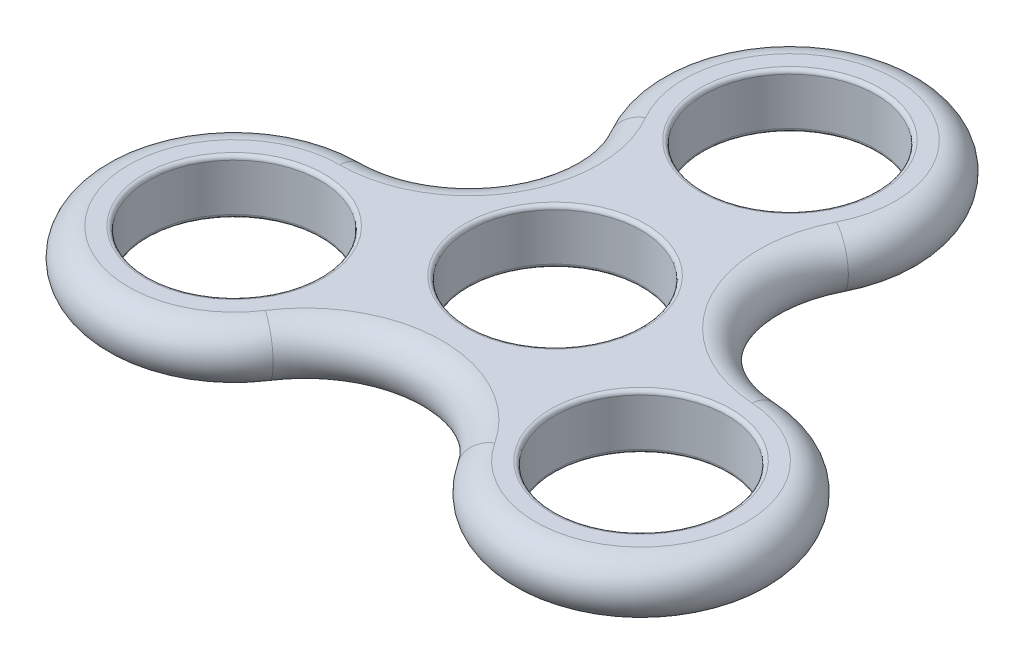
ISO-10303-21;
HEADER;
FILE_DESCRIPTION(('STEP AP214'),'2;1');
FILE_NAME('part.step','',(''),(''),'','','');
FILE_SCHEMA(('AUTOMOTIVE_DESIGN { 1 0 10303 214 1 1 1 1 }'));
ENDSEC;
DATA;
#1=APPLICATION_CONTEXT('core data for automotive mechanical design processes');
#2=APPLICATION_PROTOCOL_DEFINITION('international standard','automotive_design',2000,#1);
#3=PRODUCT_CONTEXT('',#1,'mechanical');
#4=PRODUCT('Part','Part','',(#3));
#5=PRODUCT_RELATED_PRODUCT_CATEGORY('part','',(#4));
#6=PRODUCT_DEFINITION_FORMATION('','',#4);
#7=PRODUCT_DEFINITION_CONTEXT('part definition',#1,'design');
#8=PRODUCT_DEFINITION('design','',#6,#7);
#9=PRODUCT_DEFINITION_SHAPE('','',#8);
#10=(LENGTH_UNIT() NAMED_UNIT(*) SI_UNIT(.MILLI.,.METRE.));
#11=(NAMED_UNIT(*) PLANE_ANGLE_UNIT() SI_UNIT($,.RADIAN.));
#12=(NAMED_UNIT(*) SI_UNIT($,.STERADIAN.) SOLID_ANGLE_UNIT());
#13=UNCERTAINTY_MEASURE_WITH_UNIT(LENGTH_MEASURE(1.E-05),#10,'distance_accuracy_value','');
#14=(GEOMETRIC_REPRESENTATION_CONTEXT(3) GLOBAL_UNCERTAINTY_ASSIGNED_CONTEXT((#13)) GLOBAL_UNIT_ASSIGNED_CONTEXT((#10,
#11,#12)) REPRESENTATION_CONTEXT('',''));
#15=CARTESIAN_POINT('',(0.,0.,0.));
#16=DIRECTION('',(0.,0.,1.));
#17=DIRECTION('',(1.,0.,0.));
#18=AXIS2_PLACEMENT_3D('',#15,#16,#17);
#19=CARTESIAN_POINT('',(0.,0.,-30.));
#20=DIRECTION('',(0.,1.,0.));
#21=DIRECTION('',(0.,0.,1.));
#22=AXIS2_PLACEMENT_3D('',#19,#20,#21);
#23=TOROIDAL_SURFACE('',#22,13.5,3.5);
#24=CARTESIAN_POINT('',(-11.6913429510899,0.,-23.25));
#25=DIRECTION('',(0.5,0.,0.866025403784438));
#26=DIRECTION('',(0.866025403784438,0.,-0.5));
#27=AXIS2_PLACEMENT_3D('',#24,#25,#26);
#28=CIRCLE('',#27,3.5);
#29=CARTESIAN_POINT('',(-11.6913429510899,3.5,-23.25));
#30=VERTEX_POINT('',#29);
#31=CARTESIAN_POINT('',(-11.6913429510899,-3.5,-23.25));
#32=VERTEX_POINT('',#31);
#33=EDGE_CURVE('E111',#30,#32,#28,.T.);
#34=ORIENTED_EDGE('',*,*,#33,.F.);
#35=CARTESIAN_POINT('',(0.,3.5,-30.));
#36=DIRECTION('',(0.,1.,0.));
#37=DIRECTION('',(0.,0.,1.));
#38=AXIS2_PLACEMENT_3D('',#35,#36,#37);
#39=CIRCLE('',#38,13.5);
#40=CARTESIAN_POINT('',(12.0351191687318,3.5,-23.8839631627643));
#41=VERTEX_POINT('',#40);
#42=EDGE_CURVE('E119',#41,#30,#39,.T.);
#43=ORIENTED_EDGE('',*,*,#42,.F.);
#44=CARTESIAN_POINT('',(12.0351191687318,0.,-23.8839631627643));
#45=DIRECTION('',(0.453039765721165,0.,-0.891490308794948));
#46=DIRECTION('',(-0.891490308794948,0.,-0.453039765721165));
#47=AXIS2_PLACEMENT_3D('',#44,#45,#46);
#48=CIRCLE('',#47,3.5);
#49=CARTESIAN_POINT('',(12.0351191687318,-3.5,-23.8839631627643));
#50=VERTEX_POINT('',#49);
#51=EDGE_CURVE('E100',#41,#50,#48,.T.);
#52=ORIENTED_EDGE('',*,*,#51,.T.);
#53=CARTESIAN_POINT('',(0.,-3.5,-30.));
#54=DIRECTION('',(0.,1.,0.));
#55=DIRECTION('',(0.,0.,1.));
#56=AXIS2_PLACEMENT_3D('',#53,#54,#55);
#57=CIRCLE('',#56,13.5);
#58=EDGE_CURVE('E141',#32,#50,#57,.F.);
#59=ORIENTED_EDGE('',*,*,#58,.F.);
#60=EDGE_LOOP('',(#34,#43,#52,#59));
#61=FACE_BOUND('',#60,.T.);
#62=ADVANCED_FACE('F45',(#61),#23,.T.);
#63=CARTESIAN_POINT('',(27.6361995726434,0.,-15.9557672626439));
#64=DIRECTION('',(0.,-1.,0.));
#65=DIRECTION('',(0.,0.,-1.));
#66=AXIS2_PLACEMENT_3D('',#63,#64,#65);
#67=TOROIDAL_SURFACE('',#66,17.5,3.5);
#68=ORIENTED_EDGE('',*,*,#51,.F.);
#69=CARTESIAN_POINT('',(27.6361995726434,3.5,-15.9557672626439));
#70=DIRECTION('',(0.,1.,0.));
#71=DIRECTION('',(0.,0.,1.));
#72=AXIS2_PLACEMENT_3D('',#69,#70,#71);
#73=CIRCLE('',#72,17.5);
#74=CARTESIAN_POINT('',(26.7016784263715,3.5,1.51926264368736));
#75=VERTEX_POINT('',#74);
#76=EDGE_CURVE('E103',#75,#41,#73,.F.);
#77=ORIENTED_EDGE('',*,*,#76,.F.);
#78=CARTESIAN_POINT('',(26.7016784263715,0.,1.51926264368736));
#79=DIRECTION('',(-0.998573137504641,0.,-0.0534012083583956));
#80=DIRECTION('',(-0.0534012083583956,0.,0.998573137504641));
#81=AXIS2_PLACEMENT_3D('',#78,#79,#80);
#82=CIRCLE('',#81,3.5);
#83=CARTESIAN_POINT('',(26.7016784263715,-3.5,1.51926264368736));
#84=VERTEX_POINT('',#83);
#85=EDGE_CURVE('E112',#75,#84,#82,.T.);
#86=ORIENTED_EDGE('',*,*,#85,.T.);
#87=CARTESIAN_POINT('',(27.6361995726434,-3.5,-15.9557672626439));
#88=DIRECTION('',(0.,1.,0.));
#89=DIRECTION('',(0.,0.,1.));
#90=AXIS2_PLACEMENT_3D('',#87,#88,#89);
#91=CIRCLE('',#90,17.5);
#92=EDGE_CURVE('E105',#50,#84,#91,.T.);
#93=ORIENTED_EDGE('',*,*,#92,.F.);
#94=EDGE_LOOP('',(#68,#77,#86,#93));
#95=FACE_BOUND('',#94,.T.);
#96=ADVANCED_FACE('F102',(#95),#67,.T.);
#97=CARTESIAN_POINT('',(25.9807621135332,0.,15.));
#98=DIRECTION('',(0.,1.,0.));
#99=DIRECTION('',(0.,0.,1.));
#100=AXIS2_PLACEMENT_3D('',#97,#98,#99);
#101=TOROIDAL_SURFACE('',#100,13.5,3.5);
#102=ORIENTED_EDGE('',*,*,#85,.F.);
#103=CARTESIAN_POINT('',(25.9807621135332,3.5,15.));
#104=DIRECTION('',(0.,1.,0.));
#105=DIRECTION('',(0.,0.,1.));
#106=AXIS2_PLACEMENT_3D('',#103,#104,#105);
#107=CIRCLE('',#106,13.5);
#108=CARTESIAN_POINT('',(14.6665592576397,3.5,22.364700519077));
#109=VERTEX_POINT('',#108);
#110=EDGE_CURVE('E122',#109,#75,#107,.T.);
#111=ORIENTED_EDGE('',*,*,#110,.F.);
#112=CARTESIAN_POINT('',(14.6665592576397,0.,22.364700519077));
#113=DIRECTION('',(0.545533371783476,0.,0.838089100436554));
#114=DIRECTION('',(0.838089100436554,0.,-0.545533371783476));
#115=AXIS2_PLACEMENT_3D('',#112,#113,#114);
#116=CIRCLE('',#115,3.5);
#117=CARTESIAN_POINT('',(14.6665592576397,-3.5,22.364700519077));
#118=VERTEX_POINT('',#117);
#119=EDGE_CURVE('E166',#109,#118,#116,.T.);
#120=ORIENTED_EDGE('',*,*,#119,.T.);
#121=CARTESIAN_POINT('',(25.9807621135332,-3.5,15.));
#122=DIRECTION('',(0.,1.,0.));
#123=DIRECTION('',(0.,0.,1.));
#124=AXIS2_PLACEMENT_3D('',#121,#122,#123);
#125=CIRCLE('',#124,13.5);
#126=EDGE_CURVE('E146',#84,#118,#125,.F.);
#127=ORIENTED_EDGE('',*,*,#126,.F.);
#128=EDGE_LOOP('',(#102,#111,#120,#127));
#129=FACE_BOUND('',#128,.T.);
#130=ADVANCED_FACE('F248',(#129),#101,.T.);
#131=CARTESIAN_POINT('',(0.,0.,31.9115345252878));
#132=DIRECTION('',(0.,-1.,0.));
#133=DIRECTION('',(0.,0.,-1.));
#134=AXIS2_PLACEMENT_3D('',#131,#132,#133);
#135=TOROIDAL_SURFACE('',#134,17.5,3.5);
#136=ORIENTED_EDGE('',*,*,#119,.F.);
#137=CARTESIAN_POINT('',(0.,3.5,31.9115345252878));
#138=DIRECTION('',(0.,1.,0.));
#139=DIRECTION('',(0.,0.,1.));
#140=AXIS2_PLACEMENT_3D('',#137,#138,#139);
#141=CIRCLE('',#140,17.5);
#142=CARTESIAN_POINT('',(-14.6665592576397,3.5,22.3647005190769));
#143=VERTEX_POINT('',#142);
#144=EDGE_CURVE('E131',#143,#109,#141,.F.);
#145=ORIENTED_EDGE('',*,*,#144,.F.);
#146=CARTESIAN_POINT('',(-14.6665592576397,0.,22.364700519077));
#147=DIRECTION('',(0.545533371783476,0.,-0.838089100436554));
#148=DIRECTION('',(-0.838089100436554,0.,-0.545533371783476));
#149=AXIS2_PLACEMENT_3D('',#146,#147,#148);
#150=CIRCLE('',#149,3.5);
#151=CARTESIAN_POINT('',(-14.6665592576397,-3.5,22.364700519077));
#152=VERTEX_POINT('',#151);
#153=EDGE_CURVE('E69',#143,#152,#150,.T.);
#154=ORIENTED_EDGE('',*,*,#153,.T.);
#155=CARTESIAN_POINT('',(0.,-3.5,31.9115345252878));
#156=DIRECTION('',(0.,1.,0.));
#157=DIRECTION('',(0.,0.,1.));
#158=AXIS2_PLACEMENT_3D('',#155,#156,#157);
#159=CIRCLE('',#158,17.5);
#160=EDGE_CURVE('E150',#118,#152,#159,.T.);
#161=ORIENTED_EDGE('',*,*,#160,.F.);
#162=EDGE_LOOP('',(#136,#145,#154,#161));
#163=FACE_BOUND('',#162,.T.);
#164=ADVANCED_FACE('F321',(#163),#135,.T.);
#165=CARTESIAN_POINT('',(-25.9807621135332,0.,15.));
#166=DIRECTION('',(0.,1.,0.));
#167=DIRECTION('',(0.,0.,1.));
#168=AXIS2_PLACEMENT_3D('',#165,#166,#167);
#169=TOROIDAL_SURFACE('',#168,13.5,3.5);
#170=ORIENTED_EDGE('',*,*,#153,.F.);
#171=CARTESIAN_POINT('',(-25.9807621135332,3.5,15.));
#172=DIRECTION('',(0.,1.,0.));
#173=DIRECTION('',(0.,0.,1.));
#174=AXIS2_PLACEMENT_3D('',#171,#172,#173);
#175=CIRCLE('',#174,13.5);
#176=CARTESIAN_POINT('',(-25.9807621135332,3.5,1.50000000000002));
#177=VERTEX_POINT('',#176);
#178=EDGE_CURVE('E134',#177,#143,#175,.T.);
#179=ORIENTED_EDGE('',*,*,#178,.F.);
#180=CARTESIAN_POINT('',(-25.9807621135332,0.,1.50000000000002));
#181=DIRECTION('',(-1.,0.,0.));
#182=DIRECTION('',(0.,0.,1.));
#183=AXIS2_PLACEMENT_3D('',#180,#181,#182);
#184=CIRCLE('',#183,3.5);
#185=CARTESIAN_POINT('',(-25.9807621135332,-3.5,1.50000000000002));
#186=VERTEX_POINT('',#185);
#187=EDGE_CURVE('E61',#177,#186,#184,.T.);
#188=ORIENTED_EDGE('',*,*,#187,.T.);
#189=CARTESIAN_POINT('',(-25.9807621135332,-3.5,15.));
#190=DIRECTION('',(0.,1.,0.));
#191=DIRECTION('',(0.,0.,1.));
#192=AXIS2_PLACEMENT_3D('',#189,#190,#191);
#193=CIRCLE('',#192,13.5);
#194=EDGE_CURVE('E154',#152,#186,#193,.F.);
#195=ORIENTED_EDGE('',*,*,#194,.F.);
#196=EDGE_LOOP('',(#170,#179,#188,#195));
#197=FACE_BOUND('',#196,.T.);
#198=ADVANCED_FACE('F314',(#197),#169,.T.);
#199=CARTESIAN_POINT('',(-25.9807621135332,0.,-15.));
#200=DIRECTION('',(0.,-1.,0.));
#201=DIRECTION('',(0.,0.,-1.));
#202=AXIS2_PLACEMENT_3D('',#199,#200,#201);
#203=TOROIDAL_SURFACE('',#202,16.5,3.5);
#204=CARTESIAN_POINT('',(-25.9807621135332,3.5,-15.));
#205=DIRECTION('',(0.,1.,0.));
#206=DIRECTION('',(0.,0.,1.));
#207=AXIS2_PLACEMENT_3D('',#204,#205,#206);
#208=CIRCLE('',#207,16.5);
#209=EDGE_CURVE('E138',#30,#177,#208,.F.);
#210=ORIENTED_EDGE('',*,*,#209,.F.);
#211=ORIENTED_EDGE('',*,*,#33,.T.);
#212=CARTESIAN_POINT('',(-25.9807621135332,-3.5,-15.));
#213=DIRECTION('',(0.,1.,0.));
#214=DIRECTION('',(0.,0.,1.));
#215=AXIS2_PLACEMENT_3D('',#212,#213,#214);
#216=CIRCLE('',#215,16.5);
#217=EDGE_CURVE('E158',#186,#32,#216,.T.);
#218=ORIENTED_EDGE('',*,*,#217,.F.);
#219=ORIENTED_EDGE('',*,*,#187,.F.);
#220=EDGE_LOOP('',(#210,#211,#218,#219));
#221=FACE_BOUND('',#220,.T.);
#222=ADVANCED_FACE('F303',(#221),#203,.T.);
#223=CARTESIAN_POINT('',(25.9807621135332,3.5,15.));
#224=DIRECTION('',(0.,-1.,0.));
#225=DIRECTION('',(0.,0.,-1.));
#226=AXIS2_PLACEMENT_3D('',#223,#224,#225);
#227=CYLINDRICAL_SURFACE('',#226,11.0000000000001);
#228=CARTESIAN_POINT('',(25.9807621135332,-3.,15.));
#229=DIRECTION('',(0.,1.,0.));
#230=DIRECTION('',(0.,0.,1.));
#231=AXIS2_PLACEMENT_3D('',#228,#229,#230);
#232=CIRCLE('',#231,11.0000000000001);
#233=CARTESIAN_POINT('',(25.9807621135332,-3.,26.0000000000001));
#234=VERTEX_POINT('',#233);
#235=EDGE_CURVE('E217',#234,#234,#232,.F.);
#236=ORIENTED_EDGE('',*,*,#235,.T.);
#237=EDGE_LOOP('',(#236));
#238=FACE_BOUND('',#237,.T.);
#239=CARTESIAN_POINT('',(25.9807621135332,3.,15.));
#240=DIRECTION('',(0.,1.,0.));
#241=DIRECTION('',(0.,0.,1.));
#242=AXIS2_PLACEMENT_3D('',#239,#240,#241);
#243=CIRCLE('',#242,11.0000000000001);
#244=CARTESIAN_POINT('',(25.9807621135332,3.,26.0000000000001));
#245=VERTEX_POINT('',#244);
#246=EDGE_CURVE('E213',#245,#245,#243,.T.);
#247=ORIENTED_EDGE('',*,*,#246,.T.);
#248=EDGE_LOOP('',(#247));
#249=FACE_BOUND('',#248,.T.);
#250=ADVANCED_FACE('F300',(#238,#249),#227,.F.);
#251=CARTESIAN_POINT('',(0.,3.5,0.));
#252=DIRECTION('',(0.,-1.,0.));
#253=DIRECTION('',(0.,0.,-1.));
#254=AXIS2_PLACEMENT_3D('',#251,#252,#253);
#255=CYLINDRICAL_SURFACE('',#254,11.);
#256=CARTESIAN_POINT('',(0.,-3.,0.));
#257=DIRECTION('',(0.,1.,0.));
#258=DIRECTION('',(0.,0.,1.));
#259=AXIS2_PLACEMENT_3D('',#256,#257,#258);
#260=CIRCLE('',#259,11.);
#261=CARTESIAN_POINT('',(0.,-3.,11.));
#262=VERTEX_POINT('',#261);
#263=EDGE_CURVE('E193',#262,#262,#260,.F.);
#264=ORIENTED_EDGE('',*,*,#263,.T.);
#265=EDGE_LOOP('',(#264));
#266=FACE_BOUND('',#265,.T.);
#267=CARTESIAN_POINT('',(0.,3.,0.));
#268=DIRECTION('',(0.,1.,0.));
#269=DIRECTION('',(0.,0.,1.));
#270=AXIS2_PLACEMENT_3D('',#267,#268,#269);
#271=CIRCLE('',#270,11.);
#272=CARTESIAN_POINT('',(0.,3.,11.));
#273=VERTEX_POINT('',#272);
#274=EDGE_CURVE('E189',#273,#273,#271,.T.);
#275=ORIENTED_EDGE('',*,*,#274,.T.);
#276=EDGE_LOOP('',(#275));
#277=FACE_BOUND('',#276,.T.);
#278=ADVANCED_FACE('F295',(#266,#277),#255,.F.);
#279=CARTESIAN_POINT('',(0.,3.5,-30.));
#280=DIRECTION('',(0.,-1.,0.));
#281=DIRECTION('',(0.,0.,-1.));
#282=AXIS2_PLACEMENT_3D('',#279,#280,#281);
#283=CYLINDRICAL_SURFACE('',#282,11.);
#284=CARTESIAN_POINT('',(0.,-3.,-30.));
#285=DIRECTION('',(0.,1.,0.));
#286=DIRECTION('',(0.,0.,1.));
#287=AXIS2_PLACEMENT_3D('',#284,#285,#286);
#288=CIRCLE('',#287,11.);
#289=CARTESIAN_POINT('',(0.,-3.,-19.));
#290=VERTEX_POINT('',#289);
#291=EDGE_CURVE('E11',#290,#290,#288,.F.);
#292=ORIENTED_EDGE('',*,*,#291,.T.);
#293=EDGE_LOOP('',(#292));
#294=FACE_BOUND('',#293,.T.);
#295=CARTESIAN_POINT('',(0.,3.,-30.));
#296=DIRECTION('',(0.,1.,0.));
#297=DIRECTION('',(0.,0.,1.));
#298=AXIS2_PLACEMENT_3D('',#295,#296,#297);
#299=CIRCLE('',#298,11.);
#300=CARTESIAN_POINT('',(0.,3.,-19.));
#301=VERTEX_POINT('',#300);
#302=EDGE_CURVE('E54',#301,#301,#299,.T.);
#303=ORIENTED_EDGE('',*,*,#302,.T.);
#304=EDGE_LOOP('',(#303));
#305=FACE_BOUND('',#304,.T.);
#306=ADVANCED_FACE('F232',(#294,#305),#283,.F.);
#307=CARTESIAN_POINT('',(-25.9807621135332,3.5,15.));
#308=DIRECTION('',(0.,-1.,0.));
#309=DIRECTION('',(0.,0.,-1.));
#310=AXIS2_PLACEMENT_3D('',#307,#308,#309);
#311=CYLINDRICAL_SURFACE('',#310,11.0000000000003);
#312=CARTESIAN_POINT('',(-25.9807621135332,-3.,15.));
#313=DIRECTION('',(0.,1.,0.));
#314=DIRECTION('',(0.,0.,1.));
#315=AXIS2_PLACEMENT_3D('',#312,#313,#314);
#316=CIRCLE('',#315,11.0000000000003);
#317=CARTESIAN_POINT('',(-25.9807621135332,-3.,26.0000000000003));
#318=VERTEX_POINT('',#317);
#319=EDGE_CURVE('E225',#318,#318,#316,.F.);
#320=ORIENTED_EDGE('',*,*,#319,.T.);
#321=EDGE_LOOP('',(#320));
#322=FACE_BOUND('',#321,.T.);
#323=CARTESIAN_POINT('',(-25.9807621135332,3.,15.));
#324=DIRECTION('',(0.,1.,0.));
#325=DIRECTION('',(0.,0.,1.));
#326=AXIS2_PLACEMENT_3D('',#323,#324,#325);
#327=CIRCLE('',#326,11.0000000000003);
#328=CARTESIAN_POINT('',(-25.9807621135332,3.,26.0000000000003));
#329=VERTEX_POINT('',#328);
#330=EDGE_CURVE('E221',#329,#329,#327,.T.);
#331=ORIENTED_EDGE('',*,*,#330,.T.);
#332=EDGE_LOOP('',(#331));
#333=FACE_BOUND('',#332,.T.);
#334=ADVANCED_FACE('F285',(#322,#333),#311,.F.);
#335=CARTESIAN_POINT('',(0.,3.5,0.));
#336=DIRECTION('',(0.,1.,0.));
#337=DIRECTION('',(0.,0.,1.));
#338=AXIS2_PLACEMENT_3D('',#335,#336,#337);
#339=PLANE('',#338);
#340=CARTESIAN_POINT('',(0.,3.5,0.));
#341=DIRECTION('',(0.,1.,0.));
#342=DIRECTION('',(0.,0.,1.));
#343=AXIS2_PLACEMENT_3D('',#340,#341,#342);
#344=CIRCLE('',#343,11.5);
#345=CARTESIAN_POINT('',(0.,3.5,11.5));
#346=VERTEX_POINT('',#345);
#347=EDGE_CURVE('E209',#346,#346,#344,.F.);
#348=ORIENTED_EDGE('',*,*,#347,.T.);
#349=EDGE_LOOP('',(#348));
#350=FACE_BOUND('',#349,.T.);
#351=CARTESIAN_POINT('',(25.9807621135332,3.5,15.));
#352=DIRECTION('',(0.,1.,0.));
#353=DIRECTION('',(0.,0.,1.));
#354=AXIS2_PLACEMENT_3D('',#351,#352,#353);
#355=CIRCLE('',#354,11.5000000000001);
#356=CARTESIAN_POINT('',(25.9807621135332,3.5,26.5000000000001));
#357=VERTEX_POINT('',#356);
#358=EDGE_CURVE('E205',#357,#357,#355,.F.);
#359=ORIENTED_EDGE('',*,*,#358,.T.);
#360=EDGE_LOOP('',(#359));
#361=FACE_BOUND('',#360,.T.);
#362=CARTESIAN_POINT('',(-25.9807621135332,3.5,15.));
#363=DIRECTION('',(0.,1.,0.));
#364=DIRECTION('',(0.,0.,1.));
#365=AXIS2_PLACEMENT_3D('',#362,#363,#364);
#366=CIRCLE('',#365,11.5000000000003);
#367=CARTESIAN_POINT('',(-25.9807621135332,3.5,26.5000000000003));
#368=VERTEX_POINT('',#367);
#369=EDGE_CURVE('E201',#368,#368,#366,.F.);
#370=ORIENTED_EDGE('',*,*,#369,.T.);
#371=EDGE_LOOP('',(#370));
#372=FACE_BOUND('',#371,.T.);
#373=CARTESIAN_POINT('',(0.,3.5,-30.));
#374=DIRECTION('',(0.,1.,0.));
#375=DIRECTION('',(0.,0.,1.));
#376=AXIS2_PLACEMENT_3D('',#373,#374,#375);
#377=CIRCLE('',#376,11.5);
#378=CARTESIAN_POINT('',(0.,3.5,-18.5));
#379=VERTEX_POINT('',#378);
#380=EDGE_CURVE('E197',#379,#379,#377,.F.);
#381=ORIENTED_EDGE('',*,*,#380,.T.);
#382=EDGE_LOOP('',(#381));
#383=FACE_BOUND('',#382,.T.);
#384=ORIENTED_EDGE('',*,*,#42,.T.);
#385=ORIENTED_EDGE('',*,*,#209,.T.);
#386=ORIENTED_EDGE('',*,*,#178,.T.);
#387=ORIENTED_EDGE('',*,*,#144,.T.);
#388=ORIENTED_EDGE('',*,*,#110,.T.);
#389=ORIENTED_EDGE('',*,*,#76,.T.);
#390=EDGE_LOOP('',(#384,#385,#386,#387,#388,#389));
#391=FACE_BOUND('',#390,.T.);
#392=ADVANCED_FACE('F117',(#350,#361,#372,#383,#391),#339,.T.);
#393=CARTESIAN_POINT('',(0.,-3.5,0.));
#394=DIRECTION('',(0.,1.,0.));
#395=DIRECTION('',(0.,0.,1.));
#396=AXIS2_PLACEMENT_3D('',#393,#394,#395);
#397=PLANE('',#396);
#398=CARTESIAN_POINT('',(0.,-3.5,0.));
#399=DIRECTION('',(0.,1.,0.));
#400=DIRECTION('',(0.,0.,1.));
#401=AXIS2_PLACEMENT_3D('',#398,#399,#400);
#402=CIRCLE('',#401,11.5);
#403=CARTESIAN_POINT('',(0.,-3.5,11.5));
#404=VERTEX_POINT('',#403);
#405=EDGE_CURVE('E185',#404,#404,#402,.T.);
#406=ORIENTED_EDGE('',*,*,#405,.T.);
#407=EDGE_LOOP('',(#406));
#408=FACE_BOUND('',#407,.T.);
#409=CARTESIAN_POINT('',(25.9807621135332,-3.5,15.));
#410=DIRECTION('',(0.,1.,0.));
#411=DIRECTION('',(0.,0.,1.));
#412=AXIS2_PLACEMENT_3D('',#409,#410,#411);
#413=CIRCLE('',#412,11.5000000000001);
#414=CARTESIAN_POINT('',(25.9807621135332,-3.5,26.5000000000001));
#415=VERTEX_POINT('',#414);
#416=EDGE_CURVE('E181',#415,#415,#413,.T.);
#417=ORIENTED_EDGE('',*,*,#416,.T.);
#418=EDGE_LOOP('',(#417));
#419=FACE_BOUND('',#418,.T.);
#420=CARTESIAN_POINT('',(-25.9807621135332,-3.5,15.));
#421=DIRECTION('',(0.,1.,0.));
#422=DIRECTION('',(0.,0.,1.));
#423=AXIS2_PLACEMENT_3D('',#420,#421,#422);
#424=CIRCLE('',#423,11.5000000000003);
#425=CARTESIAN_POINT('',(-25.9807621135332,-3.5,26.5000000000003));
#426=VERTEX_POINT('',#425);
#427=EDGE_CURVE('E177',#426,#426,#424,.T.);
#428=ORIENTED_EDGE('',*,*,#427,.T.);
#429=EDGE_LOOP('',(#428));
#430=FACE_BOUND('',#429,.T.);
#431=CARTESIAN_POINT('',(0.,-3.5,-30.));
#432=DIRECTION('',(0.,1.,0.));
#433=DIRECTION('',(0.,0.,1.));
#434=AXIS2_PLACEMENT_3D('',#431,#432,#433);
#435=CIRCLE('',#434,11.5);
#436=CARTESIAN_POINT('',(0.,-3.5,-18.5));
#437=VERTEX_POINT('',#436);
#438=EDGE_CURVE('E173',#437,#437,#435,.T.);
#439=ORIENTED_EDGE('',*,*,#438,.T.);
#440=EDGE_LOOP('',(#439));
#441=FACE_BOUND('',#440,.T.);
#442=ORIENTED_EDGE('',*,*,#194,.T.);
#443=ORIENTED_EDGE('',*,*,#217,.T.);
#444=ORIENTED_EDGE('',*,*,#58,.T.);
#445=ORIENTED_EDGE('',*,*,#92,.T.);
#446=ORIENTED_EDGE('',*,*,#126,.T.);
#447=ORIENTED_EDGE('',*,*,#160,.T.);
#448=EDGE_LOOP('',(#442,#443,#444,#445,#446,#447));
#449=FACE_BOUND('',#448,.T.);
#450=ADVANCED_FACE('F260',(#408,#419,#430,#441,#449),#397,.F.);
#451=CARTESIAN_POINT('',(0.,-3.,0.));
#452=DIRECTION('',(0.,1.,0.));
#453=DIRECTION('',(0.,0.,1.));
#454=AXIS2_PLACEMENT_3D('',#451,#452,#453);
#455=TOROIDAL_SURFACE('',#454,11.5,0.5);
#456=ORIENTED_EDGE('',*,*,#263,.F.);
#457=EDGE_LOOP('',(#456));
#458=FACE_BOUND('',#457,.T.);
#459=ORIENTED_EDGE('',*,*,#405,.F.);
#460=EDGE_LOOP('',(#459));
#461=FACE_BOUND('',#460,.T.);
#462=ADVANCED_FACE('F256',(#458,#461),#455,.T.);
#463=CARTESIAN_POINT('',(0.,3.,0.));
#464=DIRECTION('',(0.,1.,0.));
#465=DIRECTION('',(0.,0.,1.));
#466=AXIS2_PLACEMENT_3D('',#463,#464,#465);
#467=TOROIDAL_SURFACE('',#466,11.5,0.5);
#468=ORIENTED_EDGE('',*,*,#347,.F.);
#469=EDGE_LOOP('',(#468));
#470=FACE_BOUND('',#469,.T.);
#471=ORIENTED_EDGE('',*,*,#274,.F.);
#472=EDGE_LOOP('',(#471));
#473=FACE_BOUND('',#472,.T.);
#474=ADVANCED_FACE('F259',(#470,#473),#467,.T.);
#475=CARTESIAN_POINT('',(25.9807621135332,-3.,15.));
#476=DIRECTION('',(0.,1.,0.));
#477=DIRECTION('',(0.,0.,1.));
#478=AXIS2_PLACEMENT_3D('',#475,#476,#477);
#479=TOROIDAL_SURFACE('',#478,11.5000000000001,0.5);
#480=ORIENTED_EDGE('',*,*,#235,.F.);
#481=EDGE_LOOP('',(#480));
#482=FACE_BOUND('',#481,.T.);
#483=ORIENTED_EDGE('',*,*,#416,.F.);
#484=EDGE_LOOP('',(#483));
#485=FACE_BOUND('',#484,.T.);
#486=ADVANCED_FACE('F264',(#482,#485),#479,.T.);
#487=CARTESIAN_POINT('',(25.9807621135332,3.,15.));
#488=DIRECTION('',(0.,1.,0.));
#489=DIRECTION('',(0.,0.,1.));
#490=AXIS2_PLACEMENT_3D('',#487,#488,#489);
#491=TOROIDAL_SURFACE('',#490,11.5000000000001,0.5);
#492=ORIENTED_EDGE('',*,*,#358,.F.);
#493=EDGE_LOOP('',(#492));
#494=FACE_BOUND('',#493,.T.);
#495=ORIENTED_EDGE('',*,*,#246,.F.);
#496=EDGE_LOOP('',(#495));
#497=FACE_BOUND('',#496,.T.);
#498=ADVANCED_FACE('F268',(#494,#497),#491,.T.);
#499=CARTESIAN_POINT('',(-25.9807621135332,-3.,15.));
#500=DIRECTION('',(0.,1.,0.));
#501=DIRECTION('',(0.,0.,1.));
#502=AXIS2_PLACEMENT_3D('',#499,#500,#501);
#503=TOROIDAL_SURFACE('',#502,11.5000000000003,0.5);
#504=ORIENTED_EDGE('',*,*,#319,.F.);
#505=EDGE_LOOP('',(#504));
#506=FACE_BOUND('',#505,.T.);
#507=ORIENTED_EDGE('',*,*,#427,.F.);
#508=EDGE_LOOP('',(#507));
#509=FACE_BOUND('',#508,.T.);
#510=ADVANCED_FACE('F272',(#506,#509),#503,.T.);
#511=CARTESIAN_POINT('',(-25.9807621135332,3.,15.));
#512=DIRECTION('',(0.,1.,0.));
#513=DIRECTION('',(0.,0.,1.));
#514=AXIS2_PLACEMENT_3D('',#511,#512,#513);
#515=TOROIDAL_SURFACE('',#514,11.5000000000003,0.5);
#516=ORIENTED_EDGE('',*,*,#369,.F.);
#517=EDGE_LOOP('',(#516));
#518=FACE_BOUND('',#517,.T.);
#519=ORIENTED_EDGE('',*,*,#330,.F.);
#520=EDGE_LOOP('',(#519));
#521=FACE_BOUND('',#520,.T.);
#522=ADVANCED_FACE('F240',(#518,#521),#515,.T.);
#523=CARTESIAN_POINT('',(0.,-3.,-30.));
#524=DIRECTION('',(0.,1.,0.));
#525=DIRECTION('',(0.,0.,1.));
#526=AXIS2_PLACEMENT_3D('',#523,#524,#525);
#527=TOROIDAL_SURFACE('',#526,11.5,0.5);
#528=ORIENTED_EDGE('',*,*,#291,.F.);
#529=EDGE_LOOP('',(#528));
#530=FACE_BOUND('',#529,.T.);
#531=ORIENTED_EDGE('',*,*,#438,.F.);
#532=EDGE_LOOP('',(#531));
#533=FACE_BOUND('',#532,.T.);
#534=ADVANCED_FACE('F235',(#530,#533),#527,.T.);
#535=CARTESIAN_POINT('',(0.,3.,-30.));
#536=DIRECTION('',(0.,1.,0.));
#537=DIRECTION('',(0.,0.,1.));
#538=AXIS2_PLACEMENT_3D('',#535,#536,#537);
#539=TOROIDAL_SURFACE('',#538,11.5,0.5);
#540=ORIENTED_EDGE('',*,*,#380,.F.);
#541=EDGE_LOOP('',(#540));
#542=FACE_BOUND('',#541,.T.);
#543=ORIENTED_EDGE('',*,*,#302,.F.);
#544=EDGE_LOOP('',(#543));
#545=FACE_BOUND('',#544,.T.);
#546=ADVANCED_FACE('F47',(#542,#545),#539,.T.);
#547=CLOSED_SHELL('',(#62,#96,#130,#164,#198,#222,#250,#278,#306,#334,#392,#450,#462,#474,#486,
#498,#510,#522,#534,#546));
#548=MANIFOLD_SOLID_BREP('B2',#547);
#549=ADVANCED_BREP_SHAPE_REPRESENTATION('',(#18,#548),#14);
#550=SHAPE_DEFINITION_REPRESENTATION(#9,#549);
ENDSEC;
END-ISO-10303-21;
